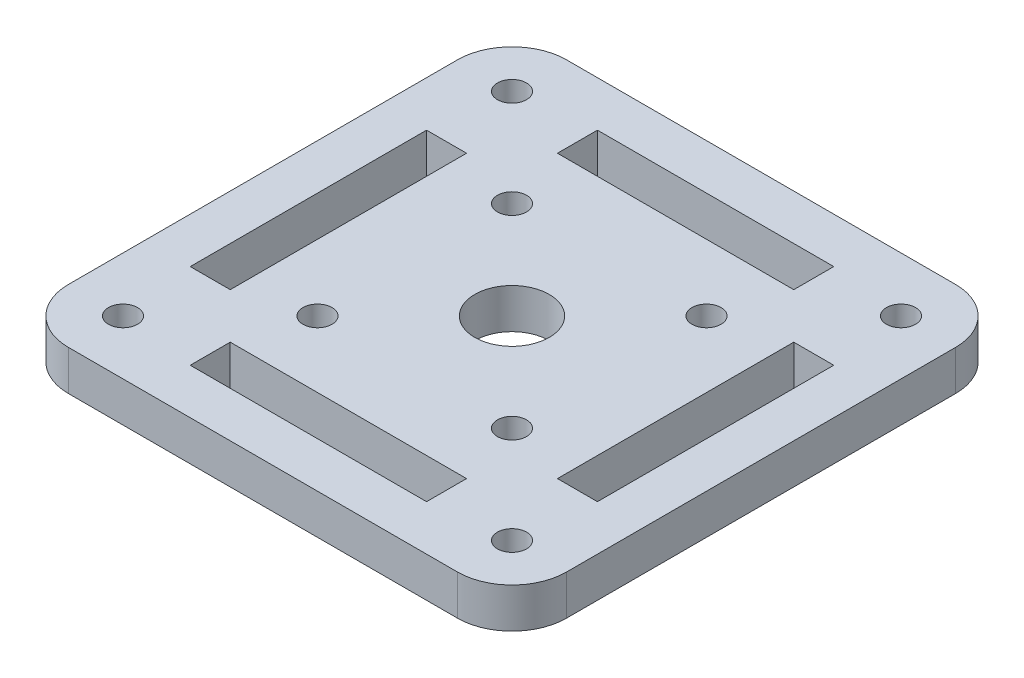
ISO-10303-21;
HEADER;
FILE_DESCRIPTION(('STEP AP214'),'2;1');
FILE_NAME('part.step','',(''),(''),'','','');
FILE_SCHEMA(('AUTOMOTIVE_DESIGN { 1 0 10303 214 1 1 1 1 }'));
ENDSEC;
DATA;
#1=APPLICATION_CONTEXT('core data for automotive mechanical design processes');
#2=APPLICATION_PROTOCOL_DEFINITION('international standard','automotive_design',2000,#1);
#3=PRODUCT_CONTEXT('',#1,'mechanical');
#4=PRODUCT('Part','Part','',(#3));
#5=PRODUCT_RELATED_PRODUCT_CATEGORY('part','',(#4));
#6=PRODUCT_DEFINITION_FORMATION('','',#4);
#7=PRODUCT_DEFINITION_CONTEXT('part definition',#1,'design');
#8=PRODUCT_DEFINITION('design','',#6,#7);
#9=PRODUCT_DEFINITION_SHAPE('','',#8);
#10=(LENGTH_UNIT() NAMED_UNIT(*) SI_UNIT(.MILLI.,.METRE.));
#11=(NAMED_UNIT(*) PLANE_ANGLE_UNIT() SI_UNIT($,.RADIAN.));
#12=(NAMED_UNIT(*) SI_UNIT($,.STERADIAN.) SOLID_ANGLE_UNIT());
#13=UNCERTAINTY_MEASURE_WITH_UNIT(LENGTH_MEASURE(1.E-05),#10,'distance_accuracy_value','');
#14=(GEOMETRIC_REPRESENTATION_CONTEXT(3) GLOBAL_UNCERTAINTY_ASSIGNED_CONTEXT((#13)) GLOBAL_UNIT_ASSIGNED_CONTEXT((#10,
#11,#12)) REPRESENTATION_CONTEXT('',''));
#15=CARTESIAN_POINT('',(0.,0.,0.));
#16=DIRECTION('',(0.,0.,1.));
#17=DIRECTION('',(1.,0.,0.));
#18=AXIS2_PLACEMENT_3D('',#15,#16,#17);
#19=CARTESIAN_POINT('',(0.,4.4,0.));
#20=DIRECTION('',(0.,1.,0.));
#21=DIRECTION('',(0.,0.,1.));
#22=AXIS2_PLACEMENT_3D('',#19,#20,#21);
#23=PLANE('',#22);
#24=CARTESIAN_POINT('',(10.7000000000006,4.4,10.7));
#25=DIRECTION('',(0.,1.,0.));
#26=DIRECTION('',(0.,0.,1.));
#27=AXIS2_PLACEMENT_3D('',#24,#25,#26);
#28=CIRCLE('',#27,1.59999999999985);
#29=CARTESIAN_POINT('',(10.7000000000006,4.4,12.2999999999999));
#30=VERTEX_POINT('',#29);
#31=EDGE_CURVE('E425',#30,#30,#28,.T.);
#32=ORIENTED_EDGE('',*,*,#31,.F.);
#33=EDGE_LOOP('',(#32));
#34=FACE_BOUND('',#33,.T.);
#35=CARTESIAN_POINT('',(-10.6999999999994,4.4,10.7000000000006));
#36=DIRECTION('',(0.,1.,0.));
#37=DIRECTION('',(0.,0.,1.));
#38=AXIS2_PLACEMENT_3D('',#35,#36,#37);
#39=CIRCLE('',#38,1.60000000000044);
#40=CARTESIAN_POINT('',(-10.6999999999994,4.4,12.3000000000011));
#41=VERTEX_POINT('',#40);
#42=EDGE_CURVE('E439',#41,#41,#39,.T.);
#43=ORIENTED_EDGE('',*,*,#42,.F.);
#44=EDGE_LOOP('',(#43));
#45=FACE_BOUND('',#44,.T.);
#46=CARTESIAN_POINT('',(-10.7,4.4,-10.6999999999994));
#47=DIRECTION('',(0.,1.,0.));
#48=DIRECTION('',(0.,0.,1.));
#49=AXIS2_PLACEMENT_3D('',#46,#47,#48);
#50=CIRCLE('',#49,1.60000000000064);
#51=CARTESIAN_POINT('',(-10.7,4.4,-9.09999999999877));
#52=VERTEX_POINT('',#51);
#53=EDGE_CURVE('E436',#52,#52,#50,.T.);
#54=ORIENTED_EDGE('',*,*,#53,.F.);
#55=EDGE_LOOP('',(#54));
#56=FACE_BOUND('',#55,.T.);
#57=CARTESIAN_POINT('',(10.7,4.4,-10.7));
#58=DIRECTION('',(0.,1.,0.));
#59=DIRECTION('',(0.,0.,1.));
#60=AXIS2_PLACEMENT_3D('',#57,#58,#59);
#61=CIRCLE('',#60,1.6);
#62=CARTESIAN_POINT('',(10.7,4.4,-9.10000000000004));
#63=VERTEX_POINT('',#62);
#64=EDGE_CURVE('E421',#63,#63,#61,.T.);
#65=ORIENTED_EDGE('',*,*,#64,.F.);
#66=EDGE_LOOP('',(#65));
#67=FACE_BOUND('',#66,.T.);
#68=CARTESIAN_POINT('',(-21.4,4.4,21.4000000000001));
#69=DIRECTION('',(0.,1.,0.));
#70=DIRECTION('',(0.,0.,1.));
#71=AXIS2_PLACEMENT_3D('',#68,#69,#70);
#72=CIRCLE('',#71,1.6);
#73=CARTESIAN_POINT('',(-21.4,4.4,23.0000000000001));
#74=VERTEX_POINT('',#73);
#75=EDGE_CURVE('E281',#74,#74,#72,.T.);
#76=ORIENTED_EDGE('',*,*,#75,.F.);
#77=EDGE_LOOP('',(#76));
#78=FACE_BOUND('',#77,.T.);
#79=CARTESIAN_POINT('',(21.4,4.4,-21.4000000000001));
#80=DIRECTION('',(0.,1.,0.));
#81=DIRECTION('',(0.,0.,1.));
#82=AXIS2_PLACEMENT_3D('',#79,#80,#81);
#83=CIRCLE('',#82,1.6);
#84=CARTESIAN_POINT('',(21.4,4.4,-19.8000000000001));
#85=VERTEX_POINT('',#84);
#86=EDGE_CURVE('E324',#85,#85,#83,.T.);
#87=ORIENTED_EDGE('',*,*,#86,.F.);
#88=EDGE_LOOP('',(#87));
#89=FACE_BOUND('',#88,.T.);
#90=DIRECTION('',(0.,0.,1.));
#91=VECTOR('',#90,1.);
#92=CARTESIAN_POINT('',(-27.4,4.4,-27.4000000000001));
#93=LINE('',#92,#91);
#94=CARTESIAN_POINT('',(-27.4,4.4,-21.4000000000001));
#95=VERTEX_POINT('',#94);
#96=CARTESIAN_POINT('',(-27.4,4.4,21.4000000000001));
#97=VERTEX_POINT('',#96);
#98=EDGE_CURVE('E373',#95,#97,#93,.T.);
#99=ORIENTED_EDGE('',*,*,#98,.T.);
#100=CARTESIAN_POINT('',(-21.4,4.4,21.4000000000001));
#101=DIRECTION('',(0.,1.,0.));
#102=DIRECTION('',(0.,0.,1.));
#103=AXIS2_PLACEMENT_3D('',#100,#101,#102);
#104=CIRCLE('',#103,6.);
#105=CARTESIAN_POINT('',(-21.4,4.4,27.4000000000001));
#106=VERTEX_POINT('',#105);
#107=EDGE_CURVE('E411',#97,#106,#104,.T.);
#108=ORIENTED_EDGE('',*,*,#107,.T.);
#109=DIRECTION('',(1.,0.,0.));
#110=VECTOR('',#109,1.);
#111=CARTESIAN_POINT('',(-27.4,4.4,27.4000000000001));
#112=LINE('',#111,#110);
#113=CARTESIAN_POINT('',(21.4,4.4,27.4000000000001));
#114=VERTEX_POINT('',#113);
#115=EDGE_CURVE('E376',#106,#114,#112,.T.);
#116=ORIENTED_EDGE('',*,*,#115,.T.);
#117=CARTESIAN_POINT('',(21.4,4.4,21.4000000000001));
#118=DIRECTION('',(0.,1.,0.));
#119=DIRECTION('',(0.,0.,1.));
#120=AXIS2_PLACEMENT_3D('',#117,#118,#119);
#121=CIRCLE('',#120,6.);
#122=CARTESIAN_POINT('',(27.4,4.4,21.4000000000001));
#123=VERTEX_POINT('',#122);
#124=EDGE_CURVE('E406',#114,#123,#121,.T.);
#125=ORIENTED_EDGE('',*,*,#124,.T.);
#126=DIRECTION('',(0.,0.,-1.));
#127=VECTOR('',#126,1.);
#128=CARTESIAN_POINT('',(27.4,4.4,-27.4000000000001));
#129=LINE('',#128,#127);
#130=CARTESIAN_POINT('',(27.4,4.4,-21.4000000000001));
#131=VERTEX_POINT('',#130);
#132=EDGE_CURVE('E368',#123,#131,#129,.T.);
#133=ORIENTED_EDGE('',*,*,#132,.T.);
#134=CARTESIAN_POINT('',(21.4,4.4,-21.4000000000001));
#135=DIRECTION('',(0.,1.,0.));
#136=DIRECTION('',(0.,0.,1.));
#137=AXIS2_PLACEMENT_3D('',#134,#135,#136);
#138=CIRCLE('',#137,6.);
#139=CARTESIAN_POINT('',(21.4,4.4,-27.4000000000001));
#140=VERTEX_POINT('',#139);
#141=EDGE_CURVE('E59',#131,#140,#138,.T.);
#142=ORIENTED_EDGE('',*,*,#141,.T.);
#143=DIRECTION('',(-1.,0.,0.));
#144=VECTOR('',#143,1.);
#145=CARTESIAN_POINT('',(-27.4,4.4,-27.4000000000001));
#146=LINE('',#145,#144);
#147=CARTESIAN_POINT('',(-21.4,4.4,-27.4000000000001));
#148=VERTEX_POINT('',#147);
#149=EDGE_CURVE('E370',#140,#148,#146,.T.);
#150=ORIENTED_EDGE('',*,*,#149,.T.);
#151=CARTESIAN_POINT('',(-21.4,4.4,-21.4000000000001));
#152=DIRECTION('',(0.,1.,0.));
#153=DIRECTION('',(0.,0.,1.));
#154=AXIS2_PLACEMENT_3D('',#151,#152,#153);
#155=CIRCLE('',#154,6.);
#156=EDGE_CURVE('E409',#148,#95,#155,.T.);
#157=ORIENTED_EDGE('',*,*,#156,.T.);
#158=EDGE_LOOP('',(#99,#108,#116,#125,#133,#142,#150,#157));
#159=FACE_BOUND('',#158,.T.);
#160=CARTESIAN_POINT('',(0.,4.4,0.));
#161=DIRECTION('',(0.,1.,0.));
#162=DIRECTION('',(0.,0.,1.));
#163=AXIS2_PLACEMENT_3D('',#160,#161,#162);
#164=CIRCLE('',#163,4.1);
#165=CARTESIAN_POINT('',(0.,4.4,4.1));
#166=VERTEX_POINT('',#165);
#167=EDGE_CURVE('E362',#166,#166,#164,.T.);
#168=ORIENTED_EDGE('',*,*,#167,.F.);
#169=EDGE_LOOP('',(#168));
#170=FACE_BOUND('',#169,.T.);
#171=DIRECTION('',(0.,0.,-1.));
#172=VECTOR('',#171,1.);
#173=CARTESIAN_POINT('',(22.4,4.4,13.));
#174=LINE('',#173,#172);
#175=CARTESIAN_POINT('',(22.4,4.4,13.));
#176=VERTEX_POINT('',#175);
#177=CARTESIAN_POINT('',(22.4,4.4,-13.));
#178=VERTEX_POINT('',#177);
#179=EDGE_CURVE('E332',#176,#178,#174,.T.);
#180=ORIENTED_EDGE('',*,*,#179,.F.);
#181=DIRECTION('',(1.,0.,0.));
#182=VECTOR('',#181,1.);
#183=CARTESIAN_POINT('',(18.,4.4,13.));
#184=LINE('',#183,#182);
#185=CARTESIAN_POINT('',(18.,4.4,13.));
#186=VERTEX_POINT('',#185);
#187=EDGE_CURVE('E330',#186,#176,#184,.T.);
#188=ORIENTED_EDGE('',*,*,#187,.F.);
#189=DIRECTION('',(0.,0.,1.));
#190=VECTOR('',#189,1.);
#191=CARTESIAN_POINT('',(18.,4.4,-5.));
#192=LINE('',#191,#190);
#193=CARTESIAN_POINT('',(18.,4.4,-13.));
#194=VERTEX_POINT('',#193);
#195=EDGE_CURVE('E338',#194,#186,#192,.T.);
#196=ORIENTED_EDGE('',*,*,#195,.F.);
#197=DIRECTION('',(-1.,0.,0.));
#198=VECTOR('',#197,1.);
#199=CARTESIAN_POINT('',(18.,4.4,-13.));
#200=LINE('',#199,#198);
#201=EDGE_CURVE('E335',#178,#194,#200,.T.);
#202=ORIENTED_EDGE('',*,*,#201,.F.);
#203=EDGE_LOOP('',(#180,#188,#196,#202));
#204=FACE_BOUND('',#203,.T.);
#205=CARTESIAN_POINT('',(21.4,4.4,21.4000000000001));
#206=DIRECTION('',(0.,1.,0.));
#207=DIRECTION('',(0.,0.,-1.));
#208=AXIS2_PLACEMENT_3D('',#205,#206,#207);
#209=CIRCLE('',#208,1.6);
#210=CARTESIAN_POINT('',(21.4,4.4,19.8000000000001));
#211=VERTEX_POINT('',#210);
#212=EDGE_CURVE('E318',#211,#211,#209,.T.);
#213=ORIENTED_EDGE('',*,*,#212,.F.);
#214=EDGE_LOOP('',(#213));
#215=FACE_BOUND('',#214,.T.);
#216=DIRECTION('',(-1.,0.,0.));
#217=VECTOR('',#216,1.);
#218=CARTESIAN_POINT('',(12.9999999999999,4.4,-22.4000000000001));
#219=LINE('',#218,#217);
#220=CARTESIAN_POINT('',(12.9999999999999,4.4,-22.4000000000001));
#221=VERTEX_POINT('',#220);
#222=CARTESIAN_POINT('',(-13.0000000000001,4.4,-22.4));
#223=VERTEX_POINT('',#222);
#224=EDGE_CURVE('E292',#221,#223,#219,.T.);
#225=ORIENTED_EDGE('',*,*,#224,.F.);
#226=DIRECTION('',(0.,0.,-1.));
#227=VECTOR('',#226,1.);
#228=CARTESIAN_POINT('',(13.,4.4,-18.0000000000001));
#229=LINE('',#228,#227);
#230=CARTESIAN_POINT('',(13.,4.4,-18.0000000000001));
#231=VERTEX_POINT('',#230);
#232=EDGE_CURVE('E289',#231,#221,#229,.T.);
#233=ORIENTED_EDGE('',*,*,#232,.F.);
#234=DIRECTION('',(1.,0.,0.));
#235=VECTOR('',#234,1.);
#236=CARTESIAN_POINT('',(-5.00000000000006,4.4,-18.));
#237=LINE('',#236,#235);
#238=CARTESIAN_POINT('',(-13.0000000000001,4.4,-18.));
#239=VERTEX_POINT('',#238);
#240=EDGE_CURVE('E287',#239,#231,#237,.T.);
#241=ORIENTED_EDGE('',*,*,#240,.F.);
#242=DIRECTION('',(0.,0.,1.));
#243=VECTOR('',#242,1.);
#244=CARTESIAN_POINT('',(-13.0000000000001,4.4,-18.));
#245=LINE('',#244,#243);
#246=EDGE_CURVE('E294',#223,#239,#245,.T.);
#247=ORIENTED_EDGE('',*,*,#246,.F.);
#248=EDGE_LOOP('',(#225,#233,#241,#247));
#249=FACE_BOUND('',#248,.T.);
#250=CARTESIAN_POINT('',(-21.4,4.4,-21.4000000000001));
#251=DIRECTION('',(0.,1.,0.));
#252=DIRECTION('',(0.,0.,-1.));
#253=AXIS2_PLACEMENT_3D('',#250,#251,#252);
#254=CIRCLE('',#253,1.6);
#255=CARTESIAN_POINT('',(-21.4,4.4,-23.0000000000001));
#256=VERTEX_POINT('',#255);
#257=EDGE_CURVE('E275',#256,#256,#254,.T.);
#258=ORIENTED_EDGE('',*,*,#257,.F.);
#259=EDGE_LOOP('',(#258));
#260=FACE_BOUND('',#259,.T.);
#261=DIRECTION('',(1.,0.,0.));
#262=VECTOR('',#261,1.);
#263=CARTESIAN_POINT('',(-13.0000000000001,4.4,22.4));
#264=LINE('',#263,#262);
#265=CARTESIAN_POINT('',(-13.0000000000001,4.4,22.4));
#266=VERTEX_POINT('',#265);
#267=CARTESIAN_POINT('',(12.9999999999999,4.4,22.4000000000001));
#268=VERTEX_POINT('',#267);
#269=EDGE_CURVE('E249',#266,#268,#264,.T.);
#270=ORIENTED_EDGE('',*,*,#269,.F.);
#271=DIRECTION('',(0.,0.,1.));
#272=VECTOR('',#271,1.);
#273=CARTESIAN_POINT('',(-13.0000000000001,4.4,18.));
#274=LINE('',#273,#272);
#275=CARTESIAN_POINT('',(-13.0000000000001,4.4,18.));
#276=VERTEX_POINT('',#275);
#277=EDGE_CURVE('E246',#276,#266,#274,.T.);
#278=ORIENTED_EDGE('',*,*,#277,.F.);
#279=DIRECTION('',(-1.,0.,0.));
#280=VECTOR('',#279,1.);
#281=CARTESIAN_POINT('',(4.99999999999995,4.4,18.));
#282=LINE('',#281,#280);
#283=CARTESIAN_POINT('',(13.,4.4,18.0000000000001));
#284=VERTEX_POINT('',#283);
#285=EDGE_CURVE('E244',#284,#276,#282,.T.);
#286=ORIENTED_EDGE('',*,*,#285,.F.);
#287=DIRECTION('',(0.,0.,-1.));
#288=VECTOR('',#287,1.);
#289=CARTESIAN_POINT('',(13.,4.4,18.0000000000001));
#290=LINE('',#289,#288);
#291=EDGE_CURVE('E251',#268,#284,#290,.T.);
#292=ORIENTED_EDGE('',*,*,#291,.F.);
#293=EDGE_LOOP('',(#270,#278,#286,#292));
#294=FACE_BOUND('',#293,.T.);
#295=DIRECTION('',(-1.,0.,0.));
#296=VECTOR('',#295,1.);
#297=CARTESIAN_POINT('',(-17.9999999999999,4.4,-13.0000000000001));
#298=LINE('',#297,#296);
#299=CARTESIAN_POINT('',(-17.9999999999999,4.4,-13.0000000000001));
#300=VERTEX_POINT('',#299);
#301=CARTESIAN_POINT('',(-22.3999999999999,4.4,-13.0000000000002));
#302=VERTEX_POINT('',#301);
#303=EDGE_CURVE('E209',#300,#302,#298,.T.);
#304=ORIENTED_EDGE('',*,*,#303,.F.);
#305=DIRECTION('',(0.,0.,-1.));
#306=VECTOR('',#305,1.);
#307=CARTESIAN_POINT('',(-18.,4.4,4.99999999999988));
#308=LINE('',#307,#306);
#309=CARTESIAN_POINT('',(-18.0000000000001,4.4,12.9999999999999));
#310=VERTEX_POINT('',#309);
#311=EDGE_CURVE('E199',#310,#300,#308,.T.);
#312=ORIENTED_EDGE('',*,*,#311,.F.);
#313=DIRECTION('',(1.,0.,0.));
#314=VECTOR('',#313,1.);
#315=CARTESIAN_POINT('',(-18.0000000000001,4.4,12.9999999999999));
#316=LINE('',#315,#314);
#317=CARTESIAN_POINT('',(-22.4000000000001,4.4,12.9999999999999));
#318=VERTEX_POINT('',#317);
#319=EDGE_CURVE('E226',#318,#310,#316,.T.);
#320=ORIENTED_EDGE('',*,*,#319,.F.);
#321=DIRECTION('',(0.,0.,1.));
#322=VECTOR('',#321,1.);
#323=CARTESIAN_POINT('',(-22.3999999999999,4.4,-13.0000000000002));
#324=LINE('',#323,#322);
#325=EDGE_CURVE('E224',#302,#318,#324,.T.);
#326=ORIENTED_EDGE('',*,*,#325,.F.);
#327=EDGE_LOOP('',(#304,#312,#320,#326));
#328=FACE_BOUND('',#327,.T.);
#329=ADVANCED_FACE('F35',(#34,#45,#56,#67,#78,#89,#159,#170,#204,#215,#249,#260,#294,#328),#23,.T.);
#330=CARTESIAN_POINT('',(0.,0.,0.));
#331=DIRECTION('',(0.,1.,0.));
#332=DIRECTION('',(0.,0.,1.));
#333=AXIS2_PLACEMENT_3D('',#330,#331,#332);
#334=PLANE('',#333);
#335=CARTESIAN_POINT('',(10.7000000000006,0.,10.7));
#336=DIRECTION('',(0.,1.,0.));
#337=DIRECTION('',(0.,0.,1.));
#338=AXIS2_PLACEMENT_3D('',#335,#336,#337);
#339=CIRCLE('',#338,1.59999999999985);
#340=CARTESIAN_POINT('',(10.7000000000006,0.,12.2999999999999));
#341=VERTEX_POINT('',#340);
#342=EDGE_CURVE('E39',#341,#341,#339,.T.);
#343=ORIENTED_EDGE('',*,*,#342,.T.);
#344=EDGE_LOOP('',(#343));
#345=FACE_BOUND('',#344,.T.);
#346=CARTESIAN_POINT('',(-10.6999999999994,0.,10.7000000000006));
#347=DIRECTION('',(0.,1.,0.));
#348=DIRECTION('',(0.,0.,1.));
#349=AXIS2_PLACEMENT_3D('',#346,#347,#348);
#350=CIRCLE('',#349,1.60000000000044);
#351=CARTESIAN_POINT('',(-10.6999999999994,0.,12.3000000000011));
#352=VERTEX_POINT('',#351);
#353=EDGE_CURVE('E424',#352,#352,#350,.T.);
#354=ORIENTED_EDGE('',*,*,#353,.T.);
#355=EDGE_LOOP('',(#354));
#356=FACE_BOUND('',#355,.T.);
#357=CARTESIAN_POINT('',(-10.7,0.,-10.6999999999994));
#358=DIRECTION('',(0.,1.,0.));
#359=DIRECTION('',(0.,0.,1.));
#360=AXIS2_PLACEMENT_3D('',#357,#358,#359);
#361=CIRCLE('',#360,1.60000000000064);
#362=CARTESIAN_POINT('',(-10.7,0.,-9.09999999999877));
#363=VERTEX_POINT('',#362);
#364=EDGE_CURVE('E422',#363,#363,#361,.T.);
#365=ORIENTED_EDGE('',*,*,#364,.T.);
#366=EDGE_LOOP('',(#365));
#367=FACE_BOUND('',#366,.T.);
#368=CARTESIAN_POINT('',(10.7,0.,-10.7));
#369=DIRECTION('',(0.,1.,0.));
#370=DIRECTION('',(0.,0.,1.));
#371=AXIS2_PLACEMENT_3D('',#368,#369,#370);
#372=CIRCLE('',#371,1.6);
#373=CARTESIAN_POINT('',(10.7,0.,-9.10000000000004));
#374=VERTEX_POINT('',#373);
#375=EDGE_CURVE('E233',#374,#374,#372,.T.);
#376=ORIENTED_EDGE('',*,*,#375,.T.);
#377=EDGE_LOOP('',(#376));
#378=FACE_BOUND('',#377,.T.);
#379=DIRECTION('',(0.,0.,1.));
#380=VECTOR('',#379,1.);
#381=CARTESIAN_POINT('',(-13.0000000000001,0.,18.));
#382=LINE('',#381,#380);
#383=CARTESIAN_POINT('',(-13.0000000000001,0.,17.9999999999999));
#384=VERTEX_POINT('',#383);
#385=CARTESIAN_POINT('',(-13.0000000000001,0.,22.4));
#386=VERTEX_POINT('',#385);
#387=EDGE_CURVE('E219',#384,#386,#382,.T.);
#388=ORIENTED_EDGE('',*,*,#387,.T.);
#389=DIRECTION('',(1.,0.,0.));
#390=VECTOR('',#389,1.);
#391=CARTESIAN_POINT('',(12.9999999999999,0.,22.4000000000001));
#392=LINE('',#391,#390);
#393=CARTESIAN_POINT('',(12.9999999999999,0.,22.4000000000001));
#394=VERTEX_POINT('',#393);
#395=EDGE_CURVE('E257',#386,#394,#392,.T.);
#396=ORIENTED_EDGE('',*,*,#395,.T.);
#397=DIRECTION('',(0.,0.,-1.));
#398=VECTOR('',#397,1.);
#399=CARTESIAN_POINT('',(13.,0.,18.0000000000001));
#400=LINE('',#399,#398);
#401=CARTESIAN_POINT('',(13.,0.,18.0000000000001));
#402=VERTEX_POINT('',#401);
#403=EDGE_CURVE('E260',#394,#402,#400,.T.);
#404=ORIENTED_EDGE('',*,*,#403,.T.);
#405=DIRECTION('',(-1.,0.,0.));
#406=VECTOR('',#405,1.);
#407=CARTESIAN_POINT('',(4.99999999999995,0.,18.));
#408=LINE('',#407,#406);
#409=EDGE_CURVE('E247',#402,#384,#408,.T.);
#410=ORIENTED_EDGE('',*,*,#409,.T.);
#411=EDGE_LOOP('',(#388,#396,#404,#410));
#412=FACE_BOUND('',#411,.T.);
#413=CARTESIAN_POINT('',(21.4,0.,21.4000000000001));
#414=DIRECTION('',(0.,1.,0.));
#415=DIRECTION('',(0.,0.,-1.));
#416=AXIS2_PLACEMENT_3D('',#413,#414,#415);
#417=CIRCLE('',#416,1.6);
#418=CARTESIAN_POINT('',(21.4,0.,19.8000000000001));
#419=VERTEX_POINT('',#418);
#420=EDGE_CURVE('E317',#419,#419,#417,.T.);
#421=ORIENTED_EDGE('',*,*,#420,.T.);
#422=EDGE_LOOP('',(#421));
#423=FACE_BOUND('',#422,.T.);
#424=CARTESIAN_POINT('',(21.4,0.,-21.4000000000001));
#425=DIRECTION('',(0.,1.,0.));
#426=DIRECTION('',(0.,0.,1.));
#427=AXIS2_PLACEMENT_3D('',#424,#425,#426);
#428=CIRCLE('',#427,1.6);
#429=CARTESIAN_POINT('',(21.4,0.,-19.8000000000001));
#430=VERTEX_POINT('',#429);
#431=EDGE_CURVE('E321',#430,#430,#428,.T.);
#432=ORIENTED_EDGE('',*,*,#431,.T.);
#433=EDGE_LOOP('',(#432));
#434=FACE_BOUND('',#433,.T.);
#435=DIRECTION('',(1.,0.,0.));
#436=VECTOR('',#435,1.);
#437=CARTESIAN_POINT('',(18.,0.,13.));
#438=LINE('',#437,#436);
#439=CARTESIAN_POINT('',(18.,0.,13.));
#440=VERTEX_POINT('',#439);
#441=CARTESIAN_POINT('',(22.4,0.,13.));
#442=VERTEX_POINT('',#441);
#443=EDGE_CURVE('E327',#440,#442,#438,.T.);
#444=ORIENTED_EDGE('',*,*,#443,.T.);
#445=DIRECTION('',(0.,0.,-1.));
#446=VECTOR('',#445,1.);
#447=CARTESIAN_POINT('',(22.4,0.,-13.));
#448=LINE('',#447,#446);
#449=CARTESIAN_POINT('',(22.4,0.,-13.));
#450=VERTEX_POINT('',#449);
#451=EDGE_CURVE('E343',#442,#450,#448,.T.);
#452=ORIENTED_EDGE('',*,*,#451,.T.);
#453=DIRECTION('',(-1.,0.,0.));
#454=VECTOR('',#453,1.);
#455=CARTESIAN_POINT('',(18.,0.,-13.));
#456=LINE('',#455,#454);
#457=CARTESIAN_POINT('',(18.,0.,-13.));
#458=VERTEX_POINT('',#457);
#459=EDGE_CURVE('E346',#450,#458,#456,.T.);
#460=ORIENTED_EDGE('',*,*,#459,.T.);
#461=DIRECTION('',(0.,0.,1.));
#462=VECTOR('',#461,1.);
#463=CARTESIAN_POINT('',(18.,0.,5.));
#464=LINE('',#463,#462);
#465=EDGE_CURVE('E333',#458,#440,#464,.T.);
#466=ORIENTED_EDGE('',*,*,#465,.T.);
#467=EDGE_LOOP('',(#444,#452,#460,#466));
#468=FACE_BOUND('',#467,.T.);
#469=DIRECTION('',(1.,0.,0.));
#470=VECTOR('',#469,1.);
#471=CARTESIAN_POINT('',(-27.4,0.,27.4000000000001));
#472=LINE('',#471,#470);
#473=CARTESIAN_POINT('',(-21.4,0.,27.4000000000001));
#474=VERTEX_POINT('',#473);
#475=CARTESIAN_POINT('',(21.4,0.,27.4000000000001));
#476=VERTEX_POINT('',#475);
#477=EDGE_CURVE('E371',#474,#476,#472,.T.);
#478=ORIENTED_EDGE('',*,*,#477,.F.);
#479=CARTESIAN_POINT('',(-21.4,0.,21.4000000000001));
#480=DIRECTION('',(0.,1.,0.));
#481=DIRECTION('',(0.,0.,1.));
#482=AXIS2_PLACEMENT_3D('',#479,#480,#481);
#483=CIRCLE('',#482,6.);
#484=CARTESIAN_POINT('',(-27.4,0.,21.4000000000001));
#485=VERTEX_POINT('',#484);
#486=EDGE_CURVE('E399',#474,#485,#483,.F.);
#487=ORIENTED_EDGE('',*,*,#486,.T.);
#488=DIRECTION('',(0.,0.,1.));
#489=VECTOR('',#488,1.);
#490=CARTESIAN_POINT('',(-27.4,0.,-27.4000000000001));
#491=LINE('',#490,#489);
#492=CARTESIAN_POINT('',(-27.4,0.,-21.4000000000001));
#493=VERTEX_POINT('',#492);
#494=EDGE_CURVE('E384',#493,#485,#491,.T.);
#495=ORIENTED_EDGE('',*,*,#494,.F.);
#496=CARTESIAN_POINT('',(-21.4,0.,-21.4000000000001));
#497=DIRECTION('',(0.,1.,0.));
#498=DIRECTION('',(0.,0.,1.));
#499=AXIS2_PLACEMENT_3D('',#496,#497,#498);
#500=CIRCLE('',#499,6.);
#501=CARTESIAN_POINT('',(-21.4,0.,-27.4000000000001));
#502=VERTEX_POINT('',#501);
#503=EDGE_CURVE('E397',#493,#502,#500,.F.);
#504=ORIENTED_EDGE('',*,*,#503,.T.);
#505=DIRECTION('',(-1.,0.,0.));
#506=VECTOR('',#505,1.);
#507=CARTESIAN_POINT('',(-27.4,0.,-27.4000000000001));
#508=LINE('',#507,#506);
#509=CARTESIAN_POINT('',(21.4,0.,-27.4000000000001));
#510=VERTEX_POINT('',#509);
#511=EDGE_CURVE('E382',#510,#502,#508,.T.);
#512=ORIENTED_EDGE('',*,*,#511,.F.);
#513=CARTESIAN_POINT('',(21.4,0.,-21.4000000000001));
#514=DIRECTION('',(0.,1.,0.));
#515=DIRECTION('',(0.,0.,1.));
#516=AXIS2_PLACEMENT_3D('',#513,#514,#515);
#517=CIRCLE('',#516,6.);
#518=CARTESIAN_POINT('',(27.4,0.,-21.4000000000001));
#519=VERTEX_POINT('',#518);
#520=EDGE_CURVE('E395',#510,#519,#517,.F.);
#521=ORIENTED_EDGE('',*,*,#520,.T.);
#522=DIRECTION('',(0.,0.,-1.));
#523=VECTOR('',#522,1.);
#524=CARTESIAN_POINT('',(27.4,0.,-27.4000000000001));
#525=LINE('',#524,#523);
#526=CARTESIAN_POINT('',(27.4,0.,21.4000000000001));
#527=VERTEX_POINT('',#526);
#528=EDGE_CURVE('E365',#527,#519,#525,.T.);
#529=ORIENTED_EDGE('',*,*,#528,.F.);
#530=CARTESIAN_POINT('',(21.4,0.,21.4000000000001));
#531=DIRECTION('',(0.,1.,0.));
#532=DIRECTION('',(0.,0.,1.));
#533=AXIS2_PLACEMENT_3D('',#530,#531,#532);
#534=CIRCLE('',#533,6.);
#535=EDGE_CURVE('E393',#527,#476,#534,.F.);
#536=ORIENTED_EDGE('',*,*,#535,.T.);
#537=EDGE_LOOP('',(#478,#487,#495,#504,#512,#521,#529,#536));
#538=FACE_BOUND('',#537,.T.);
#539=CARTESIAN_POINT('',(0.,0.,0.));
#540=DIRECTION('',(0.,1.,0.));
#541=DIRECTION('',(0.,0.,1.));
#542=AXIS2_PLACEMENT_3D('',#539,#540,#541);
#543=CIRCLE('',#542,4.1);
#544=CARTESIAN_POINT('',(0.,0.,4.1));
#545=VERTEX_POINT('',#544);
#546=EDGE_CURVE('E361',#545,#545,#543,.T.);
#547=ORIENTED_EDGE('',*,*,#546,.T.);
#548=EDGE_LOOP('',(#547));
#549=FACE_BOUND('',#548,.T.);
#550=DIRECTION('',(0.,0.,-1.));
#551=VECTOR('',#550,1.);
#552=CARTESIAN_POINT('',(13.,0.,-18.0000000000001));
#553=LINE('',#552,#551);
#554=CARTESIAN_POINT('',(13.,0.,-18.));
#555=VERTEX_POINT('',#554);
#556=CARTESIAN_POINT('',(12.9999999999999,0.,-22.4000000000001));
#557=VERTEX_POINT('',#556);
#558=EDGE_CURVE('E284',#555,#557,#553,.T.);
#559=ORIENTED_EDGE('',*,*,#558,.T.);
#560=DIRECTION('',(-1.,0.,0.));
#561=VECTOR('',#560,1.);
#562=CARTESIAN_POINT('',(-13.0000000000001,0.,-22.4));
#563=LINE('',#562,#561);
#564=CARTESIAN_POINT('',(-13.0000000000001,0.,-22.4));
#565=VERTEX_POINT('',#564);
#566=EDGE_CURVE('E300',#557,#565,#563,.T.);
#567=ORIENTED_EDGE('',*,*,#566,.T.);
#568=DIRECTION('',(0.,0.,1.));
#569=VECTOR('',#568,1.);
#570=CARTESIAN_POINT('',(-13.0000000000001,0.,-18.));
#571=LINE('',#570,#569);
#572=CARTESIAN_POINT('',(-13.0000000000001,0.,-18.));
#573=VERTEX_POINT('',#572);
#574=EDGE_CURVE('E303',#565,#573,#571,.T.);
#575=ORIENTED_EDGE('',*,*,#574,.T.);
#576=DIRECTION('',(1.,0.,0.));
#577=VECTOR('',#576,1.);
#578=CARTESIAN_POINT('',(-5.00000000000006,0.,-18.));
#579=LINE('',#578,#577);
#580=EDGE_CURVE('E290',#573,#555,#579,.T.);
#581=ORIENTED_EDGE('',*,*,#580,.T.);
#582=EDGE_LOOP('',(#559,#567,#575,#581));
#583=FACE_BOUND('',#582,.T.);
#584=CARTESIAN_POINT('',(-21.4,0.,21.4000000000001));
#585=DIRECTION('',(0.,1.,0.));
#586=DIRECTION('',(0.,0.,1.));
#587=AXIS2_PLACEMENT_3D('',#584,#585,#586);
#588=CIRCLE('',#587,1.6);
#589=CARTESIAN_POINT('',(-21.4,0.,23.0000000000001));
#590=VERTEX_POINT('',#589);
#591=EDGE_CURVE('E278',#590,#590,#588,.T.);
#592=ORIENTED_EDGE('',*,*,#591,.T.);
#593=EDGE_LOOP('',(#592));
#594=FACE_BOUND('',#593,.T.);
#595=CARTESIAN_POINT('',(-21.4,0.,-21.4000000000001));
#596=DIRECTION('',(0.,1.,0.));
#597=DIRECTION('',(0.,0.,-1.));
#598=AXIS2_PLACEMENT_3D('',#595,#596,#597);
#599=CIRCLE('',#598,1.6);
#600=CARTESIAN_POINT('',(-21.4,0.,-23.0000000000001));
#601=VERTEX_POINT('',#600);
#602=EDGE_CURVE('E274',#601,#601,#599,.T.);
#603=ORIENTED_EDGE('',*,*,#602,.T.);
#604=EDGE_LOOP('',(#603));
#605=FACE_BOUND('',#604,.T.);
#606=DIRECTION('',(0.,0.,-1.));
#607=VECTOR('',#606,1.);
#608=CARTESIAN_POINT('',(-18.,0.,-5.00000000000012));
#609=LINE('',#608,#607);
#610=CARTESIAN_POINT('',(-18.0000000000001,0.,12.9999999999999));
#611=VERTEX_POINT('',#610);
#612=CARTESIAN_POINT('',(-17.9999999999999,0.,-13.0000000000001));
#613=VERTEX_POINT('',#612);
#614=EDGE_CURVE('E231',#611,#613,#609,.T.);
#615=ORIENTED_EDGE('',*,*,#614,.T.);
#616=DIRECTION('',(-1.,0.,0.));
#617=VECTOR('',#616,1.);
#618=CARTESIAN_POINT('',(-17.9999999999999,0.,-13.0000000000001));
#619=LINE('',#618,#617);
#620=CARTESIAN_POINT('',(-22.3999999999999,0.,-13.0000000000002));
#621=VERTEX_POINT('',#620);
#622=EDGE_CURVE('E217',#613,#621,#619,.T.);
#623=ORIENTED_EDGE('',*,*,#622,.T.);
#624=DIRECTION('',(0.,0.,1.));
#625=VECTOR('',#624,1.);
#626=CARTESIAN_POINT('',(-22.4000000000001,0.,12.9999999999999));
#627=LINE('',#626,#625);
#628=CARTESIAN_POINT('',(-22.4000000000001,0.,12.9999999999999));
#629=VERTEX_POINT('',#628);
#630=EDGE_CURVE('E235',#621,#629,#627,.T.);
#631=ORIENTED_EDGE('',*,*,#630,.T.);
#632=DIRECTION('',(1.,0.,0.));
#633=VECTOR('',#632,1.);
#634=CARTESIAN_POINT('',(-18.0000000000001,0.,12.9999999999999));
#635=LINE('',#634,#633);
#636=EDGE_CURVE('E210',#629,#611,#635,.T.);
#637=ORIENTED_EDGE('',*,*,#636,.T.);
#638=EDGE_LOOP('',(#615,#623,#631,#637));
#639=FACE_BOUND('',#638,.T.);
#640=ADVANCED_FACE('F450',(#345,#356,#367,#378,#412,#423,#434,#468,#538,#549,#583,#594,#605,
#639),#334,.F.);
#641=CARTESIAN_POINT('',(27.4,4.4,-27.4000000000001));
#642=DIRECTION('',(-1.,0.,0.));
#643=DIRECTION('',(0.,0.,1.));
#644=AXIS2_PLACEMENT_3D('',#641,#642,#643);
#645=PLANE('',#644);
#646=ORIENTED_EDGE('',*,*,#528,.T.);
#647=DIRECTION('',(0.,-1.,0.));
#648=VECTOR('',#647,1.);
#649=CARTESIAN_POINT('',(27.4,4.4,-21.4000000000001));
#650=LINE('',#649,#648);
#651=EDGE_CURVE('E11',#519,#131,#650,.F.);
#652=ORIENTED_EDGE('',*,*,#651,.T.);
#653=ORIENTED_EDGE('',*,*,#132,.F.);
#654=DIRECTION('',(0.,-1.,0.));
#655=VECTOR('',#654,1.);
#656=CARTESIAN_POINT('',(27.4,4.4,21.4000000000001));
#657=LINE('',#656,#655);
#658=EDGE_CURVE('E44',#123,#527,#657,.T.);
#659=ORIENTED_EDGE('',*,*,#658,.T.);
#660=EDGE_LOOP('',(#646,#652,#653,#659));
#661=FACE_BOUND('',#660,.T.);
#662=ADVANCED_FACE('F565',(#661),#645,.F.);
#663=CARTESIAN_POINT('',(-27.4,4.4,-27.4000000000001));
#664=DIRECTION('',(0.,0.,1.));
#665=DIRECTION('',(1.,0.,0.));
#666=AXIS2_PLACEMENT_3D('',#663,#664,#665);
#667=PLANE('',#666);
#668=ORIENTED_EDGE('',*,*,#511,.T.);
#669=DIRECTION('',(0.,-1.,0.));
#670=VECTOR('',#669,1.);
#671=CARTESIAN_POINT('',(-21.4,4.4,-27.4000000000001));
#672=LINE('',#671,#670);
#673=EDGE_CURVE('E52',#502,#148,#672,.F.);
#674=ORIENTED_EDGE('',*,*,#673,.T.);
#675=ORIENTED_EDGE('',*,*,#149,.F.);
#676=DIRECTION('',(0.,-1.,0.));
#677=VECTOR('',#676,1.);
#678=CARTESIAN_POINT('',(21.4,4.4,-27.4000000000001));
#679=LINE('',#678,#677);
#680=EDGE_CURVE('E413',#140,#510,#679,.T.);
#681=ORIENTED_EDGE('',*,*,#680,.T.);
#682=EDGE_LOOP('',(#668,#674,#675,#681));
#683=FACE_BOUND('',#682,.T.);
#684=ADVANCED_FACE('F572',(#683),#667,.F.);
#685=CARTESIAN_POINT('',(-27.4,4.4,-27.4000000000001));
#686=DIRECTION('',(1.,0.,0.));
#687=DIRECTION('',(0.,0.,-1.));
#688=AXIS2_PLACEMENT_3D('',#685,#686,#687);
#689=PLANE('',#688);
#690=ORIENTED_EDGE('',*,*,#494,.T.);
#691=DIRECTION('',(0.,-1.,0.));
#692=VECTOR('',#691,1.);
#693=CARTESIAN_POINT('',(-27.4,4.4,21.4000000000001));
#694=LINE('',#693,#692);
#695=EDGE_CURVE('E404',#485,#97,#694,.F.);
#696=ORIENTED_EDGE('',*,*,#695,.T.);
#697=ORIENTED_EDGE('',*,*,#98,.F.);
#698=DIRECTION('',(0.,-1.,0.));
#699=VECTOR('',#698,1.);
#700=CARTESIAN_POINT('',(-27.4,4.4,-21.4000000000001));
#701=LINE('',#700,#699);
#702=EDGE_CURVE('E401',#95,#493,#701,.T.);
#703=ORIENTED_EDGE('',*,*,#702,.T.);
#704=EDGE_LOOP('',(#690,#696,#697,#703));
#705=FACE_BOUND('',#704,.T.);
#706=ADVANCED_FACE('F568',(#705),#689,.F.);
#707=CARTESIAN_POINT('',(-27.4,4.4,27.4000000000001));
#708=DIRECTION('',(0.,0.,-1.));
#709=DIRECTION('',(-1.,0.,0.));
#710=AXIS2_PLACEMENT_3D('',#707,#708,#709);
#711=PLANE('',#710);
#712=ORIENTED_EDGE('',*,*,#115,.F.);
#713=DIRECTION('',(0.,-1.,0.));
#714=VECTOR('',#713,1.);
#715=CARTESIAN_POINT('',(-21.4,4.4,27.4000000000001));
#716=LINE('',#715,#714);
#717=EDGE_CURVE('E390',#106,#474,#716,.T.);
#718=ORIENTED_EDGE('',*,*,#717,.T.);
#719=ORIENTED_EDGE('',*,*,#477,.T.);
#720=DIRECTION('',(0.,-1.,0.));
#721=VECTOR('',#720,1.);
#722=CARTESIAN_POINT('',(21.4,4.4,27.4000000000001));
#723=LINE('',#722,#721);
#724=EDGE_CURVE('E379',#476,#114,#723,.F.);
#725=ORIENTED_EDGE('',*,*,#724,.T.);
#726=EDGE_LOOP('',(#712,#718,#719,#725));
#727=FACE_BOUND('',#726,.T.);
#728=ADVANCED_FACE('F560',(#727),#711,.F.);
#729=CARTESIAN_POINT('',(0.,4.4,0.));
#730=DIRECTION('',(0.,-1.,0.));
#731=DIRECTION('',(0.,0.,-1.));
#732=AXIS2_PLACEMENT_3D('',#729,#730,#731);
#733=CYLINDRICAL_SURFACE('',#732,4.1);
#734=ORIENTED_EDGE('',*,*,#167,.T.);
#735=EDGE_LOOP('',(#734));
#736=FACE_BOUND('',#735,.T.);
#737=ORIENTED_EDGE('',*,*,#546,.F.);
#738=EDGE_LOOP('',(#737));
#739=FACE_BOUND('',#738,.T.);
#740=ADVANCED_FACE('F557',(#736,#739),#733,.F.);
#741=CARTESIAN_POINT('',(18.,4.4,13.));
#742=DIRECTION('',(0.,0.,-1.));
#743=DIRECTION('',(-1.,0.,0.));
#744=AXIS2_PLACEMENT_3D('',#741,#742,#743);
#745=PLANE('',#744);
#746=ORIENTED_EDGE('',*,*,#443,.F.);
#747=DIRECTION('',(0.,-1.,0.));
#748=VECTOR('',#747,1.);
#749=CARTESIAN_POINT('',(18.,4.4,13.));
#750=LINE('',#749,#748);
#751=EDGE_CURVE('E340',#186,#440,#750,.T.);
#752=ORIENTED_EDGE('',*,*,#751,.F.);
#753=ORIENTED_EDGE('',*,*,#187,.T.);
#754=DIRECTION('',(0.,-1.,0.));
#755=VECTOR('',#754,1.);
#756=CARTESIAN_POINT('',(22.4,4.4,13.));
#757=LINE('',#756,#755);
#758=EDGE_CURVE('E358',#176,#442,#757,.T.);
#759=ORIENTED_EDGE('',*,*,#758,.T.);
#760=EDGE_LOOP('',(#746,#752,#753,#759));
#761=FACE_BOUND('',#760,.T.);
#762=ADVANCED_FACE('F553',(#761),#745,.T.);
#763=CARTESIAN_POINT('',(22.4,4.4,-13.));
#764=DIRECTION('',(-1.,0.,0.));
#765=DIRECTION('',(0.,0.,1.));
#766=AXIS2_PLACEMENT_3D('',#763,#764,#765);
#767=PLANE('',#766);
#768=ORIENTED_EDGE('',*,*,#451,.F.);
#769=ORIENTED_EDGE('',*,*,#758,.F.);
#770=ORIENTED_EDGE('',*,*,#179,.T.);
#771=DIRECTION('',(0.,-1.,0.));
#772=VECTOR('',#771,1.);
#773=CARTESIAN_POINT('',(22.4,4.4,-13.));
#774=LINE('',#773,#772);
#775=EDGE_CURVE('E356',#178,#450,#774,.T.);
#776=ORIENTED_EDGE('',*,*,#775,.T.);
#777=EDGE_LOOP('',(#768,#769,#770,#776));
#778=FACE_BOUND('',#777,.T.);
#779=ADVANCED_FACE('F549',(#778),#767,.T.);
#780=CARTESIAN_POINT('',(18.,4.4,-13.));
#781=DIRECTION('',(0.,0.,1.));
#782=DIRECTION('',(1.,0.,0.));
#783=AXIS2_PLACEMENT_3D('',#780,#781,#782);
#784=PLANE('',#783);
#785=ORIENTED_EDGE('',*,*,#459,.F.);
#786=ORIENTED_EDGE('',*,*,#775,.F.);
#787=ORIENTED_EDGE('',*,*,#201,.T.);
#788=DIRECTION('',(0.,-1.,0.));
#789=VECTOR('',#788,1.);
#790=CARTESIAN_POINT('',(18.,4.4,-13.));
#791=LINE('',#790,#789);
#792=EDGE_CURVE('E353',#194,#458,#791,.T.);
#793=ORIENTED_EDGE('',*,*,#792,.T.);
#794=EDGE_LOOP('',(#785,#786,#787,#793));
#795=FACE_BOUND('',#794,.T.);
#796=ADVANCED_FACE('F545',(#795),#784,.T.);
#797=CARTESIAN_POINT('',(18.,4.4,5.));
#798=DIRECTION('',(1.,0.,0.));
#799=DIRECTION('',(0.,0.,-1.));
#800=AXIS2_PLACEMENT_3D('',#797,#798,#799);
#801=PLANE('',#800);
#802=ORIENTED_EDGE('',*,*,#465,.F.);
#803=ORIENTED_EDGE('',*,*,#792,.F.);
#804=ORIENTED_EDGE('',*,*,#195,.T.);
#805=ORIENTED_EDGE('',*,*,#751,.T.);
#806=EDGE_LOOP('',(#802,#803,#804,#805));
#807=FACE_BOUND('',#806,.T.);
#808=ADVANCED_FACE('F541',(#807),#801,.T.);
#809=CARTESIAN_POINT('',(21.4,4.4,-21.4000000000001));
#810=DIRECTION('',(0.,-1.,0.));
#811=DIRECTION('',(0.,0.,-1.));
#812=AXIS2_PLACEMENT_3D('',#809,#810,#811);
#813=CYLINDRICAL_SURFACE('',#812,1.6);
#814=ORIENTED_EDGE('',*,*,#86,.T.);
#815=EDGE_LOOP('',(#814));
#816=FACE_BOUND('',#815,.T.);
#817=ORIENTED_EDGE('',*,*,#431,.F.);
#818=EDGE_LOOP('',(#817));
#819=FACE_BOUND('',#818,.T.);
#820=ADVANCED_FACE('F537',(#816,#819),#813,.F.);
#821=CARTESIAN_POINT('',(21.4,4.4,21.4000000000001));
#822=DIRECTION('',(0.,-1.,0.));
#823=DIRECTION('',(0.,0.,-1.));
#824=AXIS2_PLACEMENT_3D('',#821,#822,#823);
#825=CYLINDRICAL_SURFACE('',#824,1.6);
#826=ORIENTED_EDGE('',*,*,#212,.T.);
#827=EDGE_LOOP('',(#826));
#828=FACE_BOUND('',#827,.T.);
#829=ORIENTED_EDGE('',*,*,#420,.F.);
#830=EDGE_LOOP('',(#829));
#831=FACE_BOUND('',#830,.T.);
#832=ADVANCED_FACE('F533',(#828,#831),#825,.F.);
#833=CARTESIAN_POINT('',(13.,4.4,-18.0000000000001));
#834=DIRECTION('',(-1.,0.,0.));
#835=DIRECTION('',(0.,0.,1.));
#836=AXIS2_PLACEMENT_3D('',#833,#834,#835);
#837=PLANE('',#836);
#838=ORIENTED_EDGE('',*,*,#558,.F.);
#839=DIRECTION('',(0.,-1.,0.));
#840=VECTOR('',#839,1.);
#841=CARTESIAN_POINT('',(13.,4.4,-18.0000000000001));
#842=LINE('',#841,#840);
#843=EDGE_CURVE('E314',#231,#555,#842,.T.);
#844=ORIENTED_EDGE('',*,*,#843,.F.);
#845=ORIENTED_EDGE('',*,*,#232,.T.);
#846=DIRECTION('',(0.,-1.,0.));
#847=VECTOR('',#846,1.);
#848=CARTESIAN_POINT('',(12.9999999999999,4.4,-22.4000000000001));
#849=LINE('',#848,#847);
#850=EDGE_CURVE('E311',#221,#557,#849,.T.);
#851=ORIENTED_EDGE('',*,*,#850,.T.);
#852=EDGE_LOOP('',(#838,#844,#845,#851));
#853=FACE_BOUND('',#852,.T.);
#854=ADVANCED_FACE('F529',(#853),#837,.T.);
#855=CARTESIAN_POINT('',(-13.0000000000001,4.4,-22.4));
#856=DIRECTION('',(0.,0.,1.));
#857=DIRECTION('',(1.,0.,0.));
#858=AXIS2_PLACEMENT_3D('',#855,#856,#857);
#859=PLANE('',#858);
#860=ORIENTED_EDGE('',*,*,#566,.F.);
#861=ORIENTED_EDGE('',*,*,#850,.F.);
#862=ORIENTED_EDGE('',*,*,#224,.T.);
#863=DIRECTION('',(0.,-1.,0.));
#864=VECTOR('',#863,1.);
#865=CARTESIAN_POINT('',(-13.0000000000001,4.4,-22.4));
#866=LINE('',#865,#864);
#867=EDGE_CURVE('E309',#223,#565,#866,.T.);
#868=ORIENTED_EDGE('',*,*,#867,.T.);
#869=EDGE_LOOP('',(#860,#861,#862,#868));
#870=FACE_BOUND('',#869,.T.);
#871=ADVANCED_FACE('F525',(#870),#859,.T.);
#872=CARTESIAN_POINT('',(-13.0000000000001,4.4,-18.));
#873=DIRECTION('',(1.,0.,0.));
#874=DIRECTION('',(0.,0.,-1.));
#875=AXIS2_PLACEMENT_3D('',#872,#873,#874);
#876=PLANE('',#875);
#877=ORIENTED_EDGE('',*,*,#574,.F.);
#878=ORIENTED_EDGE('',*,*,#867,.F.);
#879=ORIENTED_EDGE('',*,*,#246,.T.);
#880=DIRECTION('',(0.,-1.,0.));
#881=VECTOR('',#880,1.);
#882=CARTESIAN_POINT('',(-13.0000000000001,4.4,-18.));
#883=LINE('',#882,#881);
#884=EDGE_CURVE('E297',#239,#573,#883,.T.);
#885=ORIENTED_EDGE('',*,*,#884,.T.);
#886=EDGE_LOOP('',(#877,#878,#879,#885));
#887=FACE_BOUND('',#886,.T.);
#888=ADVANCED_FACE('F521',(#887),#876,.T.);
#889=CARTESIAN_POINT('',(-5.00000000000006,4.4,-18.));
#890=DIRECTION('',(0.,0.,-1.));
#891=DIRECTION('',(-1.,0.,0.));
#892=AXIS2_PLACEMENT_3D('',#889,#890,#891);
#893=PLANE('',#892);
#894=ORIENTED_EDGE('',*,*,#580,.F.);
#895=ORIENTED_EDGE('',*,*,#884,.F.);
#896=ORIENTED_EDGE('',*,*,#240,.T.);
#897=ORIENTED_EDGE('',*,*,#843,.T.);
#898=EDGE_LOOP('',(#894,#895,#896,#897));
#899=FACE_BOUND('',#898,.T.);
#900=ADVANCED_FACE('F517',(#899),#893,.T.);
#901=CARTESIAN_POINT('',(-21.4,4.4,21.4000000000001));
#902=DIRECTION('',(0.,-1.,0.));
#903=DIRECTION('',(0.,0.,-1.));
#904=AXIS2_PLACEMENT_3D('',#901,#902,#903);
#905=CYLINDRICAL_SURFACE('',#904,1.6);
#906=ORIENTED_EDGE('',*,*,#75,.T.);
#907=EDGE_LOOP('',(#906));
#908=FACE_BOUND('',#907,.T.);
#909=ORIENTED_EDGE('',*,*,#591,.F.);
#910=EDGE_LOOP('',(#909));
#911=FACE_BOUND('',#910,.T.);
#912=ADVANCED_FACE('F513',(#908,#911),#905,.F.);
#913=CARTESIAN_POINT('',(-21.4,4.4,-21.4000000000001));
#914=DIRECTION('',(0.,-1.,0.));
#915=DIRECTION('',(0.,0.,-1.));
#916=AXIS2_PLACEMENT_3D('',#913,#914,#915);
#917=CYLINDRICAL_SURFACE('',#916,1.6);
#918=ORIENTED_EDGE('',*,*,#257,.T.);
#919=EDGE_LOOP('',(#918));
#920=FACE_BOUND('',#919,.T.);
#921=ORIENTED_EDGE('',*,*,#602,.F.);
#922=EDGE_LOOP('',(#921));
#923=FACE_BOUND('',#922,.T.);
#924=ADVANCED_FACE('F510',(#920,#923),#917,.F.);
#925=CARTESIAN_POINT('',(-13.0000000000001,4.4,18.));
#926=DIRECTION('',(1.,0.,0.));
#927=DIRECTION('',(0.,0.,-1.));
#928=AXIS2_PLACEMENT_3D('',#925,#926,#927);
#929=PLANE('',#928);
#930=ORIENTED_EDGE('',*,*,#387,.F.);
#931=DIRECTION('',(0.,-1.,0.));
#932=VECTOR('',#931,1.);
#933=CARTESIAN_POINT('',(-13.0000000000001,4.4,18.));
#934=LINE('',#933,#932);
#935=EDGE_CURVE('E271',#276,#384,#934,.T.);
#936=ORIENTED_EDGE('',*,*,#935,.F.);
#937=ORIENTED_EDGE('',*,*,#277,.T.);
#938=DIRECTION('',(0.,-1.,0.));
#939=VECTOR('',#938,1.);
#940=CARTESIAN_POINT('',(-13.0000000000001,4.4,22.4));
#941=LINE('',#940,#939);
#942=EDGE_CURVE('E268',#266,#386,#941,.T.);
#943=ORIENTED_EDGE('',*,*,#942,.T.);
#944=EDGE_LOOP('',(#930,#936,#937,#943));
#945=FACE_BOUND('',#944,.T.);
#946=ADVANCED_FACE('F492',(#945),#929,.T.);
#947=CARTESIAN_POINT('',(12.9999999999999,4.4,22.4000000000001));
#948=DIRECTION('',(0.,0.,-1.));
#949=DIRECTION('',(-1.,0.,0.));
#950=AXIS2_PLACEMENT_3D('',#947,#948,#949);
#951=PLANE('',#950);
#952=ORIENTED_EDGE('',*,*,#395,.F.);
#953=ORIENTED_EDGE('',*,*,#942,.F.);
#954=ORIENTED_EDGE('',*,*,#269,.T.);
#955=DIRECTION('',(0.,-1.,0.));
#956=VECTOR('',#955,1.);
#957=CARTESIAN_POINT('',(12.9999999999999,4.4,22.4000000000001));
#958=LINE('',#957,#956);
#959=EDGE_CURVE('E266',#268,#394,#958,.T.);
#960=ORIENTED_EDGE('',*,*,#959,.T.);
#961=EDGE_LOOP('',(#952,#953,#954,#960));
#962=FACE_BOUND('',#961,.T.);
#963=ADVANCED_FACE('F484',(#962),#951,.T.);
#964=CARTESIAN_POINT('',(13.,4.4,18.0000000000001));
#965=DIRECTION('',(-1.,0.,0.));
#966=DIRECTION('',(0.,0.,1.));
#967=AXIS2_PLACEMENT_3D('',#964,#965,#966);
#968=PLANE('',#967);
#969=ORIENTED_EDGE('',*,*,#403,.F.);
#970=ORIENTED_EDGE('',*,*,#959,.F.);
#971=ORIENTED_EDGE('',*,*,#291,.T.);
#972=DIRECTION('',(0.,-1.,0.));
#973=VECTOR('',#972,1.);
#974=CARTESIAN_POINT('',(13.,4.4,18.0000000000001));
#975=LINE('',#974,#973);
#976=EDGE_CURVE('E254',#284,#402,#975,.T.);
#977=ORIENTED_EDGE('',*,*,#976,.T.);
#978=EDGE_LOOP('',(#969,#970,#971,#977));
#979=FACE_BOUND('',#978,.T.);
#980=ADVANCED_FACE('F487',(#979),#968,.T.);
#981=CARTESIAN_POINT('',(4.99999999999995,4.4,18.));
#982=DIRECTION('',(0.,0.,1.));
#983=DIRECTION('',(1.,0.,0.));
#984=AXIS2_PLACEMENT_3D('',#981,#982,#983);
#985=PLANE('',#984);
#986=ORIENTED_EDGE('',*,*,#409,.F.);
#987=ORIENTED_EDGE('',*,*,#976,.F.);
#988=ORIENTED_EDGE('',*,*,#285,.T.);
#989=ORIENTED_EDGE('',*,*,#935,.T.);
#990=EDGE_LOOP('',(#986,#987,#988,#989));
#991=FACE_BOUND('',#990,.T.);
#992=ADVANCED_FACE('F495',(#991),#985,.T.);
#993=CARTESIAN_POINT('',(-18.,4.4,-5.00000000000012));
#994=DIRECTION('',(-1.,0.,0.));
#995=DIRECTION('',(0.,0.,1.));
#996=AXIS2_PLACEMENT_3D('',#993,#994,#995);
#997=PLANE('',#996);
#998=ORIENTED_EDGE('',*,*,#614,.F.);
#999=DIRECTION('',(0.,-1.,0.));
#1000=VECTOR('',#999,1.);
#1001=CARTESIAN_POINT('',(-18.0000000000001,4.4,12.9999999999999));
#1002=LINE('',#1001,#1000);
#1003=EDGE_CURVE('E205',#310,#611,#1002,.T.);
#1004=ORIENTED_EDGE('',*,*,#1003,.F.);
#1005=ORIENTED_EDGE('',*,*,#311,.T.);
#1006=DIRECTION('',(0.,-1.,0.));
#1007=VECTOR('',#1006,1.);
#1008=CARTESIAN_POINT('',(-17.9999999999999,4.4,-13.0000000000001));
#1009=LINE('',#1008,#1007);
#1010=EDGE_CURVE('E203',#300,#613,#1009,.T.);
#1011=ORIENTED_EDGE('',*,*,#1010,.T.);
#1012=EDGE_LOOP('',(#998,#1004,#1005,#1011));
#1013=FACE_BOUND('',#1012,.T.);
#1014=ADVANCED_FACE('F202',(#1013),#997,.T.);
#1015=CARTESIAN_POINT('',(-17.9999999999999,4.4,-13.0000000000001));
#1016=DIRECTION('',(0.,0.,1.));
#1017=DIRECTION('',(1.,0.,0.));
#1018=AXIS2_PLACEMENT_3D('',#1015,#1016,#1017);
#1019=PLANE('',#1018);
#1020=ORIENTED_EDGE('',*,*,#622,.F.);
#1021=ORIENTED_EDGE('',*,*,#1010,.F.);
#1022=ORIENTED_EDGE('',*,*,#303,.T.);
#1023=DIRECTION('',(0.,-1.,0.));
#1024=VECTOR('',#1023,1.);
#1025=CARTESIAN_POINT('',(-22.3999999999999,4.4,-13.0000000000002));
#1026=LINE('',#1025,#1024);
#1027=EDGE_CURVE('E220',#302,#621,#1026,.T.);
#1028=ORIENTED_EDGE('',*,*,#1027,.T.);
#1029=EDGE_LOOP('',(#1020,#1021,#1022,#1028));
#1030=FACE_BOUND('',#1029,.T.);
#1031=ADVANCED_FACE('F213',(#1030),#1019,.T.);
#1032=CARTESIAN_POINT('',(-22.4000000000001,4.4,12.9999999999999));
#1033=DIRECTION('',(1.,0.,0.));
#1034=DIRECTION('',(0.,0.,-1.));
#1035=AXIS2_PLACEMENT_3D('',#1032,#1033,#1034);
#1036=PLANE('',#1035);
#1037=ORIENTED_EDGE('',*,*,#630,.F.);
#1038=ORIENTED_EDGE('',*,*,#1027,.F.);
#1039=ORIENTED_EDGE('',*,*,#325,.T.);
#1040=DIRECTION('',(0.,-1.,0.));
#1041=VECTOR('',#1040,1.);
#1042=CARTESIAN_POINT('',(-22.4000000000001,4.4,12.9999999999999));
#1043=LINE('',#1042,#1041);
#1044=EDGE_CURVE('E241',#318,#629,#1043,.T.);
#1045=ORIENTED_EDGE('',*,*,#1044,.T.);
#1046=EDGE_LOOP('',(#1037,#1038,#1039,#1045));
#1047=FACE_BOUND('',#1046,.T.);
#1048=ADVANCED_FACE('F622',(#1047),#1036,.T.);
#1049=CARTESIAN_POINT('',(-18.0000000000001,4.4,12.9999999999999));
#1050=DIRECTION('',(0.,0.,-1.));
#1051=DIRECTION('',(-1.,0.,0.));
#1052=AXIS2_PLACEMENT_3D('',#1049,#1050,#1051);
#1053=PLANE('',#1052);
#1054=ORIENTED_EDGE('',*,*,#636,.F.);
#1055=ORIENTED_EDGE('',*,*,#1044,.F.);
#1056=ORIENTED_EDGE('',*,*,#319,.T.);
#1057=ORIENTED_EDGE('',*,*,#1003,.T.);
#1058=EDGE_LOOP('',(#1054,#1055,#1056,#1057));
#1059=FACE_BOUND('',#1058,.T.);
#1060=ADVANCED_FACE('F583',(#1059),#1053,.T.);
#1061=CARTESIAN_POINT('',(-21.4,4.4,21.4000000000001));
#1062=DIRECTION('',(0.,-1.,0.));
#1063=DIRECTION('',(0.,0.,-1.));
#1064=AXIS2_PLACEMENT_3D('',#1061,#1062,#1063);
#1065=CYLINDRICAL_SURFACE('',#1064,6.);
#1066=ORIENTED_EDGE('',*,*,#107,.F.);
#1067=ORIENTED_EDGE('',*,*,#695,.F.);
#1068=ORIENTED_EDGE('',*,*,#486,.F.);
#1069=ORIENTED_EDGE('',*,*,#717,.F.);
#1070=EDGE_LOOP('',(#1066,#1067,#1068,#1069));
#1071=FACE_BOUND('',#1070,.T.);
#1072=ADVANCED_FACE('F579',(#1071),#1065,.T.);
#1073=CARTESIAN_POINT('',(-21.4,4.4,-21.4000000000001));
#1074=DIRECTION('',(0.,-1.,0.));
#1075=DIRECTION('',(0.,0.,-1.));
#1076=AXIS2_PLACEMENT_3D('',#1073,#1074,#1075);
#1077=CYLINDRICAL_SURFACE('',#1076,6.);
#1078=ORIENTED_EDGE('',*,*,#156,.F.);
#1079=ORIENTED_EDGE('',*,*,#673,.F.);
#1080=ORIENTED_EDGE('',*,*,#503,.F.);
#1081=ORIENTED_EDGE('',*,*,#702,.F.);
#1082=EDGE_LOOP('',(#1078,#1079,#1080,#1081));
#1083=FACE_BOUND('',#1082,.T.);
#1084=ADVANCED_FACE('F582',(#1083),#1077,.T.);
#1085=CARTESIAN_POINT('',(21.4,4.4,-21.4000000000001));
#1086=DIRECTION('',(0.,-1.,0.));
#1087=DIRECTION('',(0.,0.,-1.));
#1088=AXIS2_PLACEMENT_3D('',#1085,#1086,#1087);
#1089=CYLINDRICAL_SURFACE('',#1088,6.);
#1090=ORIENTED_EDGE('',*,*,#141,.F.);
#1091=ORIENTED_EDGE('',*,*,#651,.F.);
#1092=ORIENTED_EDGE('',*,*,#520,.F.);
#1093=ORIENTED_EDGE('',*,*,#680,.F.);
#1094=EDGE_LOOP('',(#1090,#1091,#1092,#1093));
#1095=FACE_BOUND('',#1094,.T.);
#1096=ADVANCED_FACE('F586',(#1095),#1089,.T.);
#1097=CARTESIAN_POINT('',(21.4,4.4,21.4000000000001));
#1098=DIRECTION('',(0.,-1.,0.));
#1099=DIRECTION('',(0.,0.,-1.));
#1100=AXIS2_PLACEMENT_3D('',#1097,#1098,#1099);
#1101=CYLINDRICAL_SURFACE('',#1100,6.);
#1102=ORIENTED_EDGE('',*,*,#124,.F.);
#1103=ORIENTED_EDGE('',*,*,#724,.F.);
#1104=ORIENTED_EDGE('',*,*,#535,.F.);
#1105=ORIENTED_EDGE('',*,*,#658,.F.);
#1106=EDGE_LOOP('',(#1102,#1103,#1104,#1105));
#1107=FACE_BOUND('',#1106,.T.);
#1108=ADVANCED_FACE('F37',(#1107),#1101,.T.);
#1109=CARTESIAN_POINT('',(10.7,-5.6,-10.7));
#1110=DIRECTION('',(0.,1.,0.));
#1111=DIRECTION('',(0.,0.,1.));
#1112=AXIS2_PLACEMENT_3D('',#1109,#1110,#1111);
#1113=CYLINDRICAL_SURFACE('',#1112,1.6);
#1114=ORIENTED_EDGE('',*,*,#64,.T.);
#1115=EDGE_LOOP('',(#1114));
#1116=FACE_BOUND('',#1115,.T.);
#1117=ORIENTED_EDGE('',*,*,#375,.F.);
#1118=EDGE_LOOP('',(#1117));
#1119=FACE_BOUND('',#1118,.T.);
#1120=ADVANCED_FACE('F593',(#1116,#1119),#1113,.F.);
#1121=CARTESIAN_POINT('',(-10.7,-5.6,-10.6999999999994));
#1122=DIRECTION('',(0.,1.,0.));
#1123=DIRECTION('',(0.,0.,1.));
#1124=AXIS2_PLACEMENT_3D('',#1121,#1122,#1123);
#1125=CYLINDRICAL_SURFACE('',#1124,1.60000000000064);
#1126=ORIENTED_EDGE('',*,*,#53,.T.);
#1127=EDGE_LOOP('',(#1126));
#1128=FACE_BOUND('',#1127,.T.);
#1129=ORIENTED_EDGE('',*,*,#364,.F.);
#1130=EDGE_LOOP('',(#1129));
#1131=FACE_BOUND('',#1130,.T.);
#1132=ADVANCED_FACE('F633',(#1128,#1131),#1125,.F.);
#1133=CARTESIAN_POINT('',(-10.6999999999994,-5.6,10.7000000000006));
#1134=DIRECTION('',(0.,1.,0.));
#1135=DIRECTION('',(0.,0.,1.));
#1136=AXIS2_PLACEMENT_3D('',#1133,#1134,#1135);
#1137=CYLINDRICAL_SURFACE('',#1136,1.60000000000044);
#1138=ORIENTED_EDGE('',*,*,#42,.T.);
#1139=EDGE_LOOP('',(#1138));
#1140=FACE_BOUND('',#1139,.T.);
#1141=ORIENTED_EDGE('',*,*,#353,.F.);
#1142=EDGE_LOOP('',(#1141));
#1143=FACE_BOUND('',#1142,.T.);
#1144=ADVANCED_FACE('F636',(#1140,#1143),#1137,.F.);
#1145=CARTESIAN_POINT('',(10.7000000000006,-5.6,10.7));
#1146=DIRECTION('',(0.,1.,0.));
#1147=DIRECTION('',(0.,0.,1.));
#1148=AXIS2_PLACEMENT_3D('',#1145,#1146,#1147);
#1149=CYLINDRICAL_SURFACE('',#1148,1.59999999999985);
#1150=ORIENTED_EDGE('',*,*,#31,.T.);
#1151=EDGE_LOOP('',(#1150));
#1152=FACE_BOUND('',#1151,.T.);
#1153=ORIENTED_EDGE('',*,*,#342,.F.);
#1154=EDGE_LOOP('',(#1153));
#1155=FACE_BOUND('',#1154,.T.);
#1156=ADVANCED_FACE('F445',(#1152,#1155),#1149,.F.);
#1157=CLOSED_SHELL('',(#329,#640,#662,#684,#706,#728,#740,#762,#779,#796,#808,#820,#832,#854,
#871,#888,#900,#912,#924,#946,#963,#980,#992,#1014,#1031,#1048,#1060,#1072,#1084,#1096,#1108,
#1120,#1132,#1144,#1156));
#1158=MANIFOLD_SOLID_BREP('B2',#1157);
#1159=ADVANCED_BREP_SHAPE_REPRESENTATION('',(#18,#1158),#14);
#1160=SHAPE_DEFINITION_REPRESENTATION(#9,#1159);
ENDSEC;
END-ISO-10303-21;
